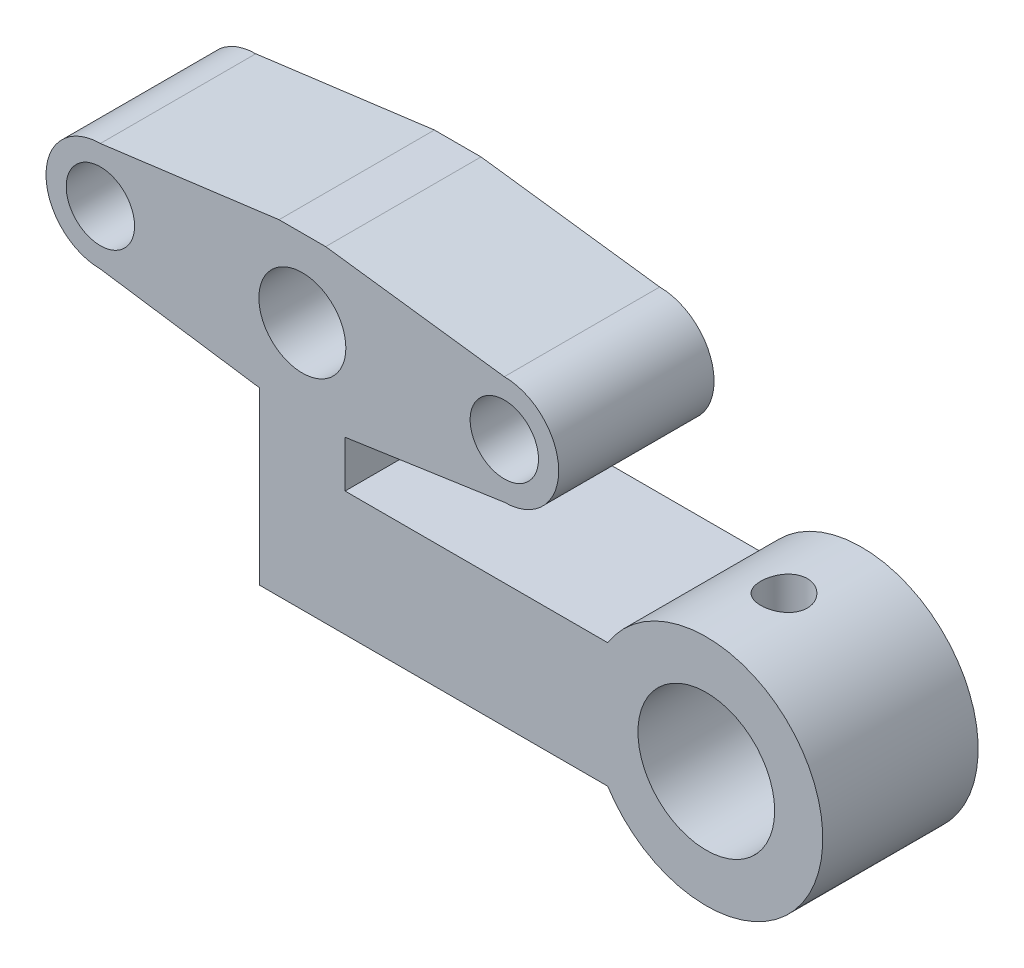
ISO-10303-21;
HEADER;
FILE_DESCRIPTION(('STEP AP214'),'2;1');
FILE_NAME('part.step','',(''),(''),'','','');
FILE_SCHEMA(('AUTOMOTIVE_DESIGN { 1 0 10303 214 1 1 1 1 }'));
ENDSEC;
DATA;
#1=APPLICATION_CONTEXT('core data for automotive mechanical design processes');
#2=APPLICATION_PROTOCOL_DEFINITION('international standard','automotive_design',2000,#1);
#3=PRODUCT_CONTEXT('',#1,'mechanical');
#4=PRODUCT('Part','Part','',(#3));
#5=PRODUCT_RELATED_PRODUCT_CATEGORY('part','',(#4));
#6=PRODUCT_DEFINITION_FORMATION('','',#4);
#7=PRODUCT_DEFINITION_CONTEXT('part definition',#1,'design');
#8=PRODUCT_DEFINITION('design','',#6,#7);
#9=PRODUCT_DEFINITION_SHAPE('','',#8);
#10=(LENGTH_UNIT() NAMED_UNIT(*) SI_UNIT(.MILLI.,.METRE.));
#11=(NAMED_UNIT(*) PLANE_ANGLE_UNIT() SI_UNIT($,.RADIAN.));
#12=(NAMED_UNIT(*) SI_UNIT($,.STERADIAN.) SOLID_ANGLE_UNIT());
#13=UNCERTAINTY_MEASURE_WITH_UNIT(LENGTH_MEASURE(1.E-05),#10,'distance_accuracy_value','');
#14=(GEOMETRIC_REPRESENTATION_CONTEXT(3) GLOBAL_UNCERTAINTY_ASSIGNED_CONTEXT((#13)) GLOBAL_UNIT_ASSIGNED_CONTEXT((#10,
#11,#12)) REPRESENTATION_CONTEXT('',''));
#15=CARTESIAN_POINT('',(0.,0.,0.));
#16=DIRECTION('',(0.,0.,1.));
#17=DIRECTION('',(1.,0.,0.));
#18=AXIS2_PLACEMENT_3D('',#15,#16,#17);
#19=CARTESIAN_POINT('',(0.,-16.,10.));
#20=DIRECTION('',(0.,1.,0.));
#21=DIRECTION('',(0.,0.,1.));
#22=AXIS2_PLACEMENT_3D('',#19,#20,#21);
#23=PLANE('',#22);
#24=DIRECTION('',(1.,0.,0.));
#25=VECTOR('',#24,1.);
#26=CARTESIAN_POINT('',(0.,-16.,0.));
#27=LINE('',#26,#25);
#28=CARTESIAN_POINT('',(-2.75,-16.,0.));
#29=VERTEX_POINT('',#28);
#30=CARTESIAN_POINT('',(19.6557112297752,-16.,0.));
#31=VERTEX_POINT('',#30);
#32=EDGE_CURVE('E163',#29,#31,#27,.T.);
#33=ORIENTED_EDGE('',*,*,#32,.T.);
#34=DIRECTION('',(0.,0.,-1.));
#35=VECTOR('',#34,1.);
#36=CARTESIAN_POINT('',(19.6557112297752,-16.,10.));
#37=LINE('',#36,#35);
#38=CARTESIAN_POINT('',(19.6557112297752,-16.,10.));
#39=VERTEX_POINT('',#38);
#40=EDGE_CURVE('E11',#39,#31,#37,.T.);
#41=ORIENTED_EDGE('',*,*,#40,.F.);
#42=DIRECTION('',(1.,0.,0.));
#43=VECTOR('',#42,1.);
#44=CARTESIAN_POINT('',(0.,-16.,10.));
#45=LINE('',#44,#43);
#46=CARTESIAN_POINT('',(-2.75,-16.,10.));
#47=VERTEX_POINT('',#46);
#48=EDGE_CURVE('E235',#47,#39,#45,.T.);
#49=ORIENTED_EDGE('',*,*,#48,.F.);
#50=DIRECTION('',(0.,0.,-1.));
#51=VECTOR('',#50,1.);
#52=CARTESIAN_POINT('',(-2.75,-16.,10.));
#53=LINE('',#52,#51);
#54=EDGE_CURVE('E159',#47,#29,#53,.T.);
#55=ORIENTED_EDGE('',*,*,#54,.T.);
#56=EDGE_LOOP('',(#33,#41,#49,#55));
#57=FACE_BOUND('',#56,.T.);
#58=ADVANCED_FACE('F34',(#57),#23,.F.);
#59=CARTESIAN_POINT('',(26.,-12.,10.));
#60=DIRECTION('',(0.,0.,-1.));
#61=DIRECTION('',(-1.,0.,0.));
#62=AXIS2_PLACEMENT_3D('',#59,#60,#61);
#63=CYLINDRICAL_SURFACE('',#62,7.5);
#64=CARTESIAN_POINT('',(24.5,-4.65153077165046,5.));
#65=CARTESIAN_POINT('',(24.5000030811876,-4.65152911461651,5.08334656323576));
#66=CARTESIAN_POINT('',(24.5069702424229,-4.65009737597381,5.16673193499975));
#67=CARTESIAN_POINT('',(24.5346315746256,-4.64453353042253,5.33114375771496));
#68=CARTESIAN_POINT('',(24.5553367293942,-4.64039926282702,5.41216826695404));
#69=CARTESIAN_POINT('',(24.6098063260704,-4.62991689417334,5.56945595503125));
#70=CARTESIAN_POINT('',(24.6435577787711,-4.62357099568418,5.64572378229887));
#71=CARTESIAN_POINT('',(24.7231263384942,-4.60938300778981,5.79151226704545));
#72=CARTESIAN_POINT('',(24.7689427720983,-4.601541001898,5.86103330080686));
#73=CARTESIAN_POINT('',(24.8720313865198,-4.58512050458629,5.99234150578078));
#74=CARTESIAN_POINT('',(24.92944151613,-4.57653393244132,6.05401938182596));
#75=CARTESIAN_POINT('',(25.053789816468,-4.559662915461,6.16693630036847));
#76=CARTESIAN_POINT('',(25.120728654533,-4.55137849183752,6.21817461112579));
#77=CARTESIAN_POINT('',(25.2629579661136,-4.53595805373657,6.30918202644269));
#78=CARTESIAN_POINT('',(25.3383161484917,-4.52883267837674,6.34884727072496));
#79=CARTESIAN_POINT('',(25.4947937744191,-4.51662394674552,6.4149124055722));
#80=CARTESIAN_POINT('',(25.5759126778692,-4.51154039933821,6.44131353785148));
#81=CARTESIAN_POINT('',(25.7404748400823,-4.50404518967372,6.47976079042944));
#82=CARTESIAN_POINT('',(25.8238733911778,-4.50159920567809,6.49199146635651));
#83=CARTESIAN_POINT('',(25.9915721473437,-4.49953618224594,6.50232642775747));
#84=CARTESIAN_POINT('',(26.0758722647478,-4.49991887020861,6.50043207446873));
#85=CARTESIAN_POINT('',(26.2417130011154,-4.50344347697227,6.48271072967667));
#86=CARTESIAN_POINT('',(26.3232758214477,-4.50654602451242,6.46708253424823));
#87=CARTESIAN_POINT('',(26.4825974398704,-4.51511734260887,6.42265245131166));
#88=CARTESIAN_POINT('',(26.5603560856207,-4.52058620783941,6.39385003671219));
#89=CARTESIAN_POINT('',(26.7104291948013,-4.53334055970062,6.3237049397791));
#90=CARTESIAN_POINT('',(26.7827062612008,-4.54063727737165,6.28228437334267));
#91=CARTESIAN_POINT('',(26.9193575687896,-4.55624295789322,6.1881363841451));
#92=CARTESIAN_POINT('',(26.9837308992875,-4.56455203717166,6.13540766034423));
#93=CARTESIAN_POINT('',(27.1039271465802,-4.5814355345331,6.01904956683729));
#94=CARTESIAN_POINT('',(27.1595814748604,-4.59001205313726,5.95524621990562));
#95=CARTESIAN_POINT('',(27.2594277397652,-4.60632642601859,5.81912533632387));
#96=CARTESIAN_POINT('',(27.3036194595916,-4.61406426443178,5.74680763867521));
#97=CARTESIAN_POINT('',(27.3793442222028,-4.62782928790614,5.5954687522673));
#98=CARTESIAN_POINT('',(27.4108499716666,-4.63385277654676,5.51643354854051));
#99=CARTESIAN_POINT('',(27.4600855124414,-4.64345285518091,5.35404301441401));
#100=CARTESIAN_POINT('',(27.477817099185,-4.64702976407358,5.27068824857137));
#101=CARTESIAN_POINT('',(27.4987490090541,-4.65126781098258,5.10355271300143));
#102=CARTESIAN_POINT('',(27.5021927883469,-4.65197779414268,5.01980363853449));
#103=CARTESIAN_POINT('',(27.4951064424661,-4.65053271466719,4.85292766520047));
#104=CARTESIAN_POINT('',(27.4845771096837,-4.64837781449418,4.7698007313217));
#105=CARTESIAN_POINT('',(27.4500533121112,-4.64149151257628,4.60734703956165));
#106=CARTESIAN_POINT('',(27.4261889312589,-4.63678501478255,4.52799148544636));
#107=CARTESIAN_POINT('',(27.3658115529628,-4.62534765972503,4.37440508145689));
#108=CARTESIAN_POINT('',(27.3292975135598,-4.61861663570595,4.30017465434642));
#109=CARTESIAN_POINT('',(27.2441062133234,-4.60377891056941,4.15788033507476));
#110=CARTESIAN_POINT('',(27.1952766169741,-4.59565542202645,4.08990943054876));
#111=CARTESIAN_POINT('',(27.0870433583191,-4.57899414260045,3.96303753199863));
#112=CARTESIAN_POINT('',(27.0276386077168,-4.57045630914273,3.90413747262612));
#113=CARTESIAN_POINT('',(26.8988484102468,-4.55376981196176,3.79615616122163));
#114=CARTESIAN_POINT('',(26.8293237483944,-4.54562913436974,3.747239518025));
#115=CARTESIAN_POINT('',(26.6829018449521,-4.5307930855707,3.66178117775062));
#116=CARTESIAN_POINT('',(26.6060049131503,-4.52409765367184,3.62523896098283));
#117=CARTESIAN_POINT('',(26.447454021236,-4.512940589084,3.56580669238005));
#118=CARTESIAN_POINT('',(26.3658300102171,-4.50846631286093,3.54283922266062));
#119=CARTESIAN_POINT('',(26.1997841820199,-4.5022014609351,3.51096312850423));
#120=CARTESIAN_POINT('',(26.1153627030668,-4.50041056200235,3.50205281078648));
#121=CARTESIAN_POINT('',(25.9476906591446,-4.49972189318819,3.49860952855567));
#122=CARTESIAN_POINT('',(25.8644452817877,-4.50077432175974,3.50382907931568));
#123=CARTESIAN_POINT('',(25.7000434530265,-4.50554934659523,3.52795092582172));
#124=CARTESIAN_POINT('',(25.6188869753695,-4.50927190928472,3.54685304952211));
#125=CARTESIAN_POINT('',(25.4611208753824,-4.518967524525,3.59769348813746));
#126=CARTESIAN_POINT('',(25.3845013351396,-4.52493544128134,3.62960206719677));
#127=CARTESIAN_POINT('',(25.2376681697211,-4.53847916814923,3.70551836199635));
#128=CARTESIAN_POINT('',(25.1674550513489,-4.54605510531172,3.74952703385557));
#129=CARTESIAN_POINT('',(25.0342041648405,-4.56213601263209,3.84922908059312));
#130=CARTESIAN_POINT('',(24.9713004258252,-4.5706539986683,3.90509950458016));
#131=CARTESIAN_POINT('',(24.8556760733647,-4.58758165644522,4.02657536014365));
#132=CARTESIAN_POINT('',(24.8029578751959,-4.59599130205524,4.09218309420307));
#133=CARTESIAN_POINT('',(24.7086616708172,-4.6118498587522,4.2321189750503));
#134=CARTESIAN_POINT('',(24.6672097780404,-4.61928744553629,4.30653344174069));
#135=CARTESIAN_POINT('',(24.5974639260682,-4.63222144222713,4.4613991599494));
#136=CARTESIAN_POINT('',(24.5691580310309,-4.63771961192251,4.54184485804634));
#137=CARTESIAN_POINT('',(24.5319962902187,-4.6450547830834,4.68539368315525));
#138=CARTESIAN_POINT('',(24.5200191522159,-4.64746822632176,4.74767812926849));
#139=CARTESIAN_POINT('',(24.504019973059,-4.65070682307289,4.87330093182915));
#140=CARTESIAN_POINT('',(24.4999976576556,-4.65153203134141,4.93663925186744));
#141=CARTESIAN_POINT('',(24.5,-4.65153077165046,5.));
#142=B_SPLINE_CURVE_WITH_KNOTS('',3,(#64,#65,#66,#67,#68,#69,#70,#71,#72,#73,#74,#75,#76,#77,
#78,#79,#80,#81,#82,#83,#84,#85,#86,#87,#88,#89,#90,#91,#92,#93,#94,#95,#96,#97,#98,#99,#100,
#101,#102,#103,#104,#105,#106,#107,#108,#109,#110,#111,#112,#113,#114,#115,#116,#117,#118,#119,
#120,#121,#122,#123,#124,#125,#126,#127,#128,#129,#130,#131,#132,#133,#134,#135,#136,#137,#138,
#139,#140,#141),.UNSPECIFIED.,.T.,.F.,(4,2,2,2,2,2,2,2,2,2,2,2,2,2,2,2,2,2,2,2,2,2,2,2,2,2,2,2,
2,2,2,2,2,2,2,2,2,2,4),(0.,0.249807695804143,0.499815358926445,0.74957474691088,
0.999320197289796,1.25223378822655,1.50516510053133,1.76030100656175,2.0154130236984,
2.26716373324621,2.51889018174372,2.76703184450306,3.01518343610625,3.26489886333455,
3.51464303655099,3.76874020143725,4.0228421718408,4.27748794759165,4.53210052524037,
4.7823563670689,5.03259801792632,5.28044012674978,5.52830265531598,5.77939589661782,
6.03051499305313,6.28548902600176,6.54045234945157,6.79394720367975,7.04741152037441,
7.29646526122029,7.54551587050135,7.79400025613177,8.04250428202026,8.29501728038395,
8.54759008334671,8.80288347868562,9.05794462633399,9.24785705455344,9.43776293526322),.UNSPECIFIED.);
#143=CARTESIAN_POINT('',(24.5,-4.65153077165046,5.));
#144=VERTEX_POINT('',#143);
#145=EDGE_CURVE('E431',#144,#144,#142,.T.);
#146=ORIENTED_EDGE('',*,*,#145,.F.);
#147=EDGE_LOOP('',(#146));
#148=FACE_BOUND('',#147,.T.);
#149=CARTESIAN_POINT('',(26.,-12.,0.));
#150=DIRECTION('',(0.,0.,1.));
#151=DIRECTION('',(1.,0.,0.));
#152=AXIS2_PLACEMENT_3D('',#149,#150,#151);
#153=CIRCLE('',#152,7.5);
#154=CARTESIAN_POINT('',(19.6557112297752,-8.,0.));
#155=VERTEX_POINT('',#154);
#156=EDGE_CURVE('E167',#31,#155,#153,.T.);
#157=ORIENTED_EDGE('',*,*,#156,.T.);
#158=DIRECTION('',(0.,0.,-1.));
#159=VECTOR('',#158,1.);
#160=CARTESIAN_POINT('',(19.6557112297752,-8.,10.));
#161=LINE('',#160,#159);
#162=CARTESIAN_POINT('',(19.6557112297752,-8.,10.));
#163=VERTEX_POINT('',#162);
#164=EDGE_CURVE('E43',#163,#155,#161,.T.);
#165=ORIENTED_EDGE('',*,*,#164,.F.);
#166=CARTESIAN_POINT('',(26.,-12.,10.));
#167=DIRECTION('',(0.,0.,1.));
#168=DIRECTION('',(1.,0.,0.));
#169=AXIS2_PLACEMENT_3D('',#166,#167,#168);
#170=CIRCLE('',#169,7.5);
#171=EDGE_CURVE('E106',#39,#163,#170,.T.);
#172=ORIENTED_EDGE('',*,*,#171,.F.);
#173=ORIENTED_EDGE('',*,*,#40,.T.);
#174=EDGE_LOOP('',(#157,#165,#172,#173));
#175=FACE_BOUND('',#174,.T.);
#176=ADVANCED_FACE('F217',(#148,#175),#63,.T.);
#177=CARTESIAN_POINT('',(0.,-8.00000000000001,10.));
#178=DIRECTION('',(0.,1.,0.));
#179=DIRECTION('',(-1.,0.,0.));
#180=AXIS2_PLACEMENT_3D('',#177,#178,#179);
#181=PLANE('',#180);
#182=DIRECTION('',(1.,0.,0.));
#183=VECTOR('',#182,1.);
#184=CARTESIAN_POINT('',(0.,-8.00000000000001,0.));
#185=LINE('',#184,#183);
#186=CARTESIAN_POINT('',(2.75,-8.,0.));
#187=VERTEX_POINT('',#186);
#188=EDGE_CURVE('E170',#187,#155,#185,.T.);
#189=ORIENTED_EDGE('',*,*,#188,.F.);
#190=DIRECTION('',(0.,0.,-1.));
#191=VECTOR('',#190,1.);
#192=CARTESIAN_POINT('',(2.75,-8.,10.));
#193=LINE('',#192,#191);
#194=CARTESIAN_POINT('',(2.75,-8.,10.));
#195=VERTEX_POINT('',#194);
#196=EDGE_CURVE('E210',#195,#187,#193,.T.);
#197=ORIENTED_EDGE('',*,*,#196,.F.);
#198=DIRECTION('',(1.,0.,0.));
#199=VECTOR('',#198,1.);
#200=CARTESIAN_POINT('',(0.,-8.00000000000001,10.));
#201=LINE('',#200,#199);
#202=EDGE_CURVE('E216',#195,#163,#201,.T.);
#203=ORIENTED_EDGE('',*,*,#202,.T.);
#204=ORIENTED_EDGE('',*,*,#164,.T.);
#205=EDGE_LOOP('',(#189,#197,#203,#204));
#206=FACE_BOUND('',#205,.T.);
#207=ADVANCED_FACE('F214',(#206),#181,.T.);
#208=CARTESIAN_POINT('',(2.75,0.,10.));
#209=DIRECTION('',(1.,0.,0.));
#210=DIRECTION('',(0.,1.,0.));
#211=AXIS2_PLACEMENT_3D('',#208,#209,#210);
#212=PLANE('',#211);
#213=DIRECTION('',(0.,-1.,0.));
#214=VECTOR('',#213,1.);
#215=CARTESIAN_POINT('',(2.75,0.,0.));
#216=LINE('',#215,#214);
#217=CARTESIAN_POINT('',(2.75,-5.,0.));
#218=VERTEX_POINT('',#217);
#219=EDGE_CURVE('E173',#218,#187,#216,.T.);
#220=ORIENTED_EDGE('',*,*,#219,.F.);
#221=DIRECTION('',(0.,0.,-1.));
#222=VECTOR('',#221,1.);
#223=CARTESIAN_POINT('',(2.75,-5.,10.));
#224=LINE('',#223,#222);
#225=CARTESIAN_POINT('',(2.75,-5.,10.));
#226=VERTEX_POINT('',#225);
#227=EDGE_CURVE('E208',#226,#218,#224,.T.);
#228=ORIENTED_EDGE('',*,*,#227,.F.);
#229=DIRECTION('',(0.,-1.,0.));
#230=VECTOR('',#229,1.);
#231=CARTESIAN_POINT('',(2.75,0.,10.));
#232=LINE('',#231,#230);
#233=EDGE_CURVE('E231',#226,#195,#232,.T.);
#234=ORIENTED_EDGE('',*,*,#233,.T.);
#235=ORIENTED_EDGE('',*,*,#196,.T.);
#236=EDGE_LOOP('',(#220,#228,#234,#235));
#237=FACE_BOUND('',#236,.T.);
#238=ADVANCED_FACE('F227',(#237),#212,.T.);
#239=CARTESIAN_POINT('',(0.774024461269656,-5.28916715200932,10.));
#240=DIRECTION('',(-0.144799180117186,0.989461064134103,0.));
#241=DIRECTION('',(-0.989461064134103,-0.144799180117186,0.));
#242=AXIS2_PLACEMENT_3D('',#239,#240,#241);
#243=PLANE('',#242);
#244=DIRECTION('',(0.989461064134103,0.144799180117186,0.));
#245=VECTOR('',#244,1.);
#246=CARTESIAN_POINT('',(0.774024461269656,-5.28916715200932,0.));
#247=LINE('',#246,#245);
#248=CARTESIAN_POINT('',(13.,-3.5,0.));
#249=VERTEX_POINT('',#248);
#250=EDGE_CURVE('E176',#218,#249,#247,.T.);
#251=ORIENTED_EDGE('',*,*,#250,.T.);
#252=DIRECTION('',(0.,0.,-1.));
#253=VECTOR('',#252,1.);
#254=CARTESIAN_POINT('',(13.,-3.5,10.));
#255=LINE('',#254,#253);
#256=CARTESIAN_POINT('',(13.,-3.5,10.));
#257=VERTEX_POINT('',#256);
#258=EDGE_CURVE('E205',#257,#249,#255,.T.);
#259=ORIENTED_EDGE('',*,*,#258,.F.);
#260=DIRECTION('',(0.989461064134103,0.144799180117186,0.));
#261=VECTOR('',#260,1.);
#262=CARTESIAN_POINT('',(0.774024461269656,-5.28916715200932,10.));
#263=LINE('',#262,#261);
#264=EDGE_CURVE('E233',#226,#257,#263,.T.);
#265=ORIENTED_EDGE('',*,*,#264,.F.);
#266=ORIENTED_EDGE('',*,*,#227,.T.);
#267=EDGE_LOOP('',(#251,#259,#265,#266));
#268=FACE_BOUND('',#267,.T.);
#269=ADVANCED_FACE('F279',(#268),#243,.F.);
#270=CARTESIAN_POINT('',(13.,0.,10.));
#271=DIRECTION('',(0.,0.,-1.));
#272=DIRECTION('',(-1.,0.,0.));
#273=AXIS2_PLACEMENT_3D('',#270,#271,#272);
#274=CYLINDRICAL_SURFACE('',#273,3.5);
#275=CARTESIAN_POINT('',(13.,0.,0.));
#276=DIRECTION('',(0.,0.,1.));
#277=DIRECTION('',(1.,0.,0.));
#278=AXIS2_PLACEMENT_3D('',#275,#276,#277);
#279=CIRCLE('',#278,3.5);
#280=CARTESIAN_POINT('',(13.,3.5,0.));
#281=VERTEX_POINT('',#280);
#282=EDGE_CURVE('E178',#249,#281,#279,.T.);
#283=ORIENTED_EDGE('',*,*,#282,.T.);
#284=DIRECTION('',(0.,0.,-1.));
#285=VECTOR('',#284,1.);
#286=CARTESIAN_POINT('',(13.,3.5,10.));
#287=LINE('',#286,#285);
#288=CARTESIAN_POINT('',(13.,3.5,10.));
#289=VERTEX_POINT('',#288);
#290=EDGE_CURVE('E203',#289,#281,#287,.T.);
#291=ORIENTED_EDGE('',*,*,#290,.F.);
#292=CARTESIAN_POINT('',(13.,0.,10.));
#293=DIRECTION('',(0.,0.,1.));
#294=DIRECTION('',(1.,0.,0.));
#295=AXIS2_PLACEMENT_3D('',#292,#293,#294);
#296=CIRCLE('',#295,3.5);
#297=EDGE_CURVE('E240',#257,#289,#296,.T.);
#298=ORIENTED_EDGE('',*,*,#297,.F.);
#299=ORIENTED_EDGE('',*,*,#258,.T.);
#300=EDGE_LOOP('',(#283,#291,#298,#299));
#301=FACE_BOUND('',#300,.T.);
#302=ADVANCED_FACE('F282',(#301),#274,.T.);
#303=CARTESIAN_POINT('',(0.66635687732342,5.10873605947955,10.));
#304=DIRECTION('',(0.129339184067768,0.991600411186222,0.));
#305=DIRECTION('',(-0.991600411186222,0.129339184067768,0.));
#306=AXIS2_PLACEMENT_3D('',#303,#304,#305);
#307=PLANE('',#306);
#308=DIRECTION('',(0.991600411186222,-0.129339184067768,0.));
#309=VECTOR('',#308,1.);
#310=CARTESIAN_POINT('',(0.66635687732342,5.10873605947955,0.));
#311=LINE('',#310,#309);
#312=CARTESIAN_POINT('',(1.5,5.,0.));
#313=VERTEX_POINT('',#312);
#314=EDGE_CURVE('E181',#313,#281,#311,.T.);
#315=ORIENTED_EDGE('',*,*,#314,.F.);
#316=DIRECTION('',(0.,0.,-1.));
#317=VECTOR('',#316,1.);
#318=CARTESIAN_POINT('',(1.5,5.,10.));
#319=LINE('',#318,#317);
#320=CARTESIAN_POINT('',(1.5,5.,10.));
#321=VERTEX_POINT('',#320);
#322=EDGE_CURVE('E201',#321,#313,#319,.T.);
#323=ORIENTED_EDGE('',*,*,#322,.F.);
#324=DIRECTION('',(0.991600411186222,-0.129339184067768,0.));
#325=VECTOR('',#324,1.);
#326=CARTESIAN_POINT('',(0.66635687732342,5.10873605947955,10.));
#327=LINE('',#326,#325);
#328=EDGE_CURVE('E242',#321,#289,#327,.T.);
#329=ORIENTED_EDGE('',*,*,#328,.T.);
#330=ORIENTED_EDGE('',*,*,#290,.T.);
#331=EDGE_LOOP('',(#315,#323,#329,#330));
#332=FACE_BOUND('',#331,.T.);
#333=ADVANCED_FACE('F255',(#332),#307,.T.);
#334=CARTESIAN_POINT('',(0.,5.,10.));
#335=DIRECTION('',(0.,1.,0.));
#336=DIRECTION('',(0.,0.,1.));
#337=AXIS2_PLACEMENT_3D('',#334,#335,#336);
#338=PLANE('',#337);
#339=DIRECTION('',(1.,0.,0.));
#340=VECTOR('',#339,1.);
#341=CARTESIAN_POINT('',(0.,5.,0.));
#342=LINE('',#341,#340);
#343=CARTESIAN_POINT('',(-1.5,5.,0.));
#344=VERTEX_POINT('',#343);
#345=EDGE_CURVE('E184',#344,#313,#342,.T.);
#346=ORIENTED_EDGE('',*,*,#345,.F.);
#347=DIRECTION('',(0.,0.,-1.));
#348=VECTOR('',#347,1.);
#349=CARTESIAN_POINT('',(-1.5,5.,10.));
#350=LINE('',#349,#348);
#351=CARTESIAN_POINT('',(-1.5,5.,10.));
#352=VERTEX_POINT('',#351);
#353=EDGE_CURVE('E199',#352,#344,#350,.T.);
#354=ORIENTED_EDGE('',*,*,#353,.F.);
#355=DIRECTION('',(1.,0.,0.));
#356=VECTOR('',#355,1.);
#357=CARTESIAN_POINT('',(0.,5.,10.));
#358=LINE('',#357,#356);
#359=EDGE_CURVE('E245',#352,#321,#358,.T.);
#360=ORIENTED_EDGE('',*,*,#359,.T.);
#361=ORIENTED_EDGE('',*,*,#322,.T.);
#362=EDGE_LOOP('',(#346,#354,#360,#361));
#363=FACE_BOUND('',#362,.T.);
#364=ADVANCED_FACE('F249',(#363),#338,.T.);
#365=CARTESIAN_POINT('',(-0.66635687732342,5.10873605947955,10.));
#366=DIRECTION('',(0.129339184067768,-0.991600411186222,0.));
#367=DIRECTION('',(0.991600411186222,0.129339184067768,0.));
#368=AXIS2_PLACEMENT_3D('',#365,#366,#367);
#369=PLANE('',#368);
#370=DIRECTION('',(-0.991600411186222,-0.129339184067768,0.));
#371=VECTOR('',#370,1.);
#372=CARTESIAN_POINT('',(-0.66635687732342,5.10873605947955,0.));
#373=LINE('',#372,#371);
#374=CARTESIAN_POINT('',(-13.,3.5,0.));
#375=VERTEX_POINT('',#374);
#376=EDGE_CURVE('E187',#344,#375,#373,.T.);
#377=ORIENTED_EDGE('',*,*,#376,.T.);
#378=DIRECTION('',(0.,0.,-1.));
#379=VECTOR('',#378,1.);
#380=CARTESIAN_POINT('',(-13.,3.5,10.));
#381=LINE('',#380,#379);
#382=CARTESIAN_POINT('',(-13.,3.5,10.));
#383=VERTEX_POINT('',#382);
#384=EDGE_CURVE('E148',#383,#375,#381,.T.);
#385=ORIENTED_EDGE('',*,*,#384,.F.);
#386=DIRECTION('',(-0.991600411186222,-0.129339184067768,0.));
#387=VECTOR('',#386,1.);
#388=CARTESIAN_POINT('',(-0.66635687732342,5.10873605947955,10.));
#389=LINE('',#388,#387);
#390=EDGE_CURVE('E139',#352,#383,#389,.T.);
#391=ORIENTED_EDGE('',*,*,#390,.F.);
#392=ORIENTED_EDGE('',*,*,#353,.T.);
#393=EDGE_LOOP('',(#377,#385,#391,#392));
#394=FACE_BOUND('',#393,.T.);
#395=ADVANCED_FACE('F258',(#394),#369,.F.);
#396=CARTESIAN_POINT('',(-13.,0.,10.));
#397=DIRECTION('',(0.,0.,-1.));
#398=DIRECTION('',(-1.,0.,0.));
#399=AXIS2_PLACEMENT_3D('',#396,#397,#398);
#400=CYLINDRICAL_SURFACE('',#399,3.5);
#401=CARTESIAN_POINT('',(-13.,0.,0.));
#402=DIRECTION('',(0.,0.,1.));
#403=DIRECTION('',(1.,0.,0.));
#404=AXIS2_PLACEMENT_3D('',#401,#402,#403);
#405=CIRCLE('',#404,3.5);
#406=CARTESIAN_POINT('',(-13.,-3.5,0.));
#407=VERTEX_POINT('',#406);
#408=EDGE_CURVE('E147',#375,#407,#405,.T.);
#409=ORIENTED_EDGE('',*,*,#408,.T.);
#410=DIRECTION('',(0.,0.,-1.));
#411=VECTOR('',#410,1.);
#412=CARTESIAN_POINT('',(-13.,-3.5,10.));
#413=LINE('',#412,#411);
#414=CARTESIAN_POINT('',(-13.,-3.5,10.));
#415=VERTEX_POINT('',#414);
#416=EDGE_CURVE('E144',#415,#407,#413,.T.);
#417=ORIENTED_EDGE('',*,*,#416,.F.);
#418=CARTESIAN_POINT('',(-13.,0.,10.));
#419=DIRECTION('',(0.,0.,1.));
#420=DIRECTION('',(1.,0.,0.));
#421=AXIS2_PLACEMENT_3D('',#418,#419,#420);
#422=CIRCLE('',#421,3.5);
#423=EDGE_CURVE('E131',#383,#415,#422,.T.);
#424=ORIENTED_EDGE('',*,*,#423,.F.);
#425=ORIENTED_EDGE('',*,*,#384,.T.);
#426=EDGE_LOOP('',(#409,#417,#424,#425));
#427=FACE_BOUND('',#426,.T.);
#428=ADVANCED_FACE('F145',(#427),#400,.T.);
#429=CARTESIAN_POINT('',(-0.774024461269657,-5.28916715200932,10.));
#430=DIRECTION('',(0.144799180117186,0.989461064134103,0.));
#431=DIRECTION('',(-0.989461064134103,0.144799180117186,0.));
#432=AXIS2_PLACEMENT_3D('',#429,#430,#431);
#433=PLANE('',#432);
#434=DIRECTION('',(0.989461064134103,-0.144799180117186,0.));
#435=VECTOR('',#434,1.);
#436=CARTESIAN_POINT('',(-0.774024461269657,-5.28916715200932,0.));
#437=LINE('',#436,#435);
#438=CARTESIAN_POINT('',(-2.75,-5.,0.));
#439=VERTEX_POINT('',#438);
#440=EDGE_CURVE('E92',#407,#439,#437,.T.);
#441=ORIENTED_EDGE('',*,*,#440,.T.);
#442=DIRECTION('',(0.,0.,-1.));
#443=VECTOR('',#442,1.);
#444=CARTESIAN_POINT('',(-2.75,-5.,10.));
#445=LINE('',#444,#443);
#446=CARTESIAN_POINT('',(-2.75,-5.,10.));
#447=VERTEX_POINT('',#446);
#448=EDGE_CURVE('E149',#447,#439,#445,.T.);
#449=ORIENTED_EDGE('',*,*,#448,.F.);
#450=DIRECTION('',(0.989461064134103,-0.144799180117186,0.));
#451=VECTOR('',#450,1.);
#452=CARTESIAN_POINT('',(-0.774024461269657,-5.28916715200932,10.));
#453=LINE('',#452,#451);
#454=EDGE_CURVE('E136',#415,#447,#453,.T.);
#455=ORIENTED_EDGE('',*,*,#454,.F.);
#456=ORIENTED_EDGE('',*,*,#416,.T.);
#457=EDGE_LOOP('',(#441,#449,#455,#456));
#458=FACE_BOUND('',#457,.T.);
#459=ADVANCED_FACE('F151',(#458),#433,.F.);
#460=CARTESIAN_POINT('',(-2.75,0.,10.));
#461=DIRECTION('',(1.,0.,0.));
#462=DIRECTION('',(0.,1.,0.));
#463=AXIS2_PLACEMENT_3D('',#460,#461,#462);
#464=PLANE('',#463);
#465=DIRECTION('',(0.,-1.,0.));
#466=VECTOR('',#465,1.);
#467=CARTESIAN_POINT('',(-2.75,0.,0.));
#468=LINE('',#467,#466);
#469=EDGE_CURVE('E98',#439,#29,#468,.T.);
#470=ORIENTED_EDGE('',*,*,#469,.T.);
#471=ORIENTED_EDGE('',*,*,#54,.F.);
#472=DIRECTION('',(0.,-1.,0.));
#473=VECTOR('',#472,1.);
#474=CARTESIAN_POINT('',(-2.75,0.,10.));
#475=LINE('',#474,#473);
#476=EDGE_CURVE('E51',#447,#47,#475,.T.);
#477=ORIENTED_EDGE('',*,*,#476,.F.);
#478=ORIENTED_EDGE('',*,*,#448,.T.);
#479=EDGE_LOOP('',(#470,#471,#477,#478));
#480=FACE_BOUND('',#479,.T.);
#481=ADVANCED_FACE('F315',(#480),#464,.F.);
#482=CARTESIAN_POINT('',(26.,-12.,10.));
#483=DIRECTION('',(0.,0.,-1.));
#484=DIRECTION('',(-1.,0.,0.));
#485=AXIS2_PLACEMENT_3D('',#482,#483,#484);
#486=CYLINDRICAL_SURFACE('',#485,4.4);
#487=CARTESIAN_POINT('',(24.5,-7.86357642401071,5.));
#488=CARTESIAN_POINT('',(24.4999992140049,-7.863577047921,5.08158258137132));
#489=CARTESIAN_POINT('',(24.5066781677432,-7.86113649022482,5.16315979491508));
#490=CARTESIAN_POINT('',(24.5331220686913,-7.85169165450791,5.32388985370917));
#491=CARTESIAN_POINT('',(24.5528886801661,-7.84468679607905,5.40304238929081));
#492=CARTESIAN_POINT('',(24.6047268269282,-7.82699702189821,5.55656711897757));
#493=CARTESIAN_POINT('',(24.6367733419379,-7.81631959349964,5.63094867653165));
#494=CARTESIAN_POINT('',(24.7121755420429,-7.79249884612861,5.77330485544053));
#495=CARTESIAN_POINT('',(24.7555338976415,-7.77935494507643,5.8412779587197));
#496=CARTESIAN_POINT('',(24.8542307763214,-7.75147873621066,5.97167100940464));
#497=CARTESIAN_POINT('',(24.9099548285264,-7.73670553793475,6.03379047556803));
#498=CARTESIAN_POINT('',(25.0309793561663,-7.70758011628093,6.14800877475378));
#499=CARTESIAN_POINT('',(25.0962814471117,-7.69322796441117,6.20010591389505));
#500=CARTESIAN_POINT('',(25.2368201689808,-7.66608612109601,6.29417851786779));
#501=CARTESIAN_POINT('',(25.3122801929456,-7.65335009479074,6.33583710161844));
#502=CARTESIAN_POINT('',(25.4696459465761,-7.63135897037674,6.40574931387181));
#503=CARTESIAN_POINT('',(25.5515498462609,-7.62210288829101,6.43400673223342));
#504=CARTESIAN_POINT('',(25.7163263895312,-7.60840429848913,6.47528951231926));
#505=CARTESIAN_POINT('',(25.7990562050845,-7.60379941126651,6.48883006481643));
#506=CARTESIAN_POINT('',(25.9657332944299,-7.5993445580618,6.50193505848136));
#507=CARTESIAN_POINT('',(26.0496802342268,-7.59949331140949,6.501503263915));
#508=CARTESIAN_POINT('',(26.2127540944233,-7.60442010527888,6.48699797019435));
#509=CARTESIAN_POINT('',(26.2919375210878,-7.60900809559142,6.47348450494978));
#510=CARTESIAN_POINT('',(26.4468367931741,-7.62205739024208,6.43412834975374));
#511=CARTESIAN_POINT('',(26.5225524005929,-7.6305189599944,6.40828481495183));
#512=CARTESIAN_POINT('',(26.6695660266196,-7.6506018242841,6.3446871883204));
#513=CARTESIAN_POINT('',(26.7407909751518,-7.66226406657544,6.30677765049067));
#514=CARTESIAN_POINT('',(26.8760307511932,-7.68754012582647,6.22025371211121));
#515=CARTESIAN_POINT('',(26.9400435025462,-7.70115450219161,6.17163624093758));
#516=CARTESIAN_POINT('',(27.0623686967465,-7.72969415304398,6.06227529034873));
#517=CARTESIAN_POINT('',(27.1202468884783,-7.7446509708599,6.0010536048047));
#518=CARTESIAN_POINT('',(27.2250595923804,-7.77363118937172,5.86965147916945));
#519=CARTESIAN_POINT('',(27.2719922526515,-7.78765443182749,5.79946952617402));
#520=CARTESIAN_POINT('',(27.3542206708361,-7.8133571555,5.65070538856886));
#521=CARTESIAN_POINT('',(27.3893245839833,-7.82499689747902,5.57200976784035));
#522=CARTESIAN_POINT('',(27.445632003647,-7.84415553668969,5.4093266438485));
#523=CARTESIAN_POINT('',(27.46684165869,-7.85167625644083,5.3253414993803));
#524=CARTESIAN_POINT('',(27.4938565419635,-7.86132992756908,5.15868590511855));
#525=CARTESIAN_POINT('',(27.5003380899117,-7.86369919892066,5.07613877794153));
#526=CARTESIAN_POINT('',(27.4996348530668,-7.8634438374396,4.91111985180275));
#527=CARTESIAN_POINT('',(27.4924526991635,-7.86082016597763,4.82864804139804));
#528=CARTESIAN_POINT('',(27.4652347315949,-7.85111094279887,4.66926258137984));
#529=CARTESIAN_POINT('',(27.4456776998498,-7.8441917641991,4.59225593386585));
#530=CARTESIAN_POINT('',(27.3948444319989,-7.82685667966362,4.44263577192661));
#531=CARTESIAN_POINT('',(27.3635660589245,-7.81644013614416,4.3700230613846));
#532=CARTESIAN_POINT('',(27.2890136046482,-7.79286130356569,4.22861051607496));
#533=CARTESIAN_POINT('',(27.2453796559777,-7.77962014839868,4.16001391397932));
#534=CARTESIAN_POINT('',(27.1477579923027,-7.75203336636908,4.03087243599786));
#535=CARTESIAN_POINT('',(27.0937670912458,-7.73768740045455,3.97033004751643));
#536=CARTESIAN_POINT('',(26.9737158508131,-7.70862784515774,3.85584134003732));
#537=CARTESIAN_POINT('',(26.9071824155296,-7.69393248658058,3.80238498514861));
#538=CARTESIAN_POINT('',(26.765727296046,-7.66654362041764,3.70735938599084));
#539=CARTESIAN_POINT('',(26.6908058671073,-7.65385005194219,3.66578978012403));
#540=CARTESIAN_POINT('',(26.5350304596723,-7.63194742409901,3.59608574848391));
#541=CARTESIAN_POINT('',(26.4542164338421,-7.62271710775932,3.56786907515922));
#542=CARTESIAN_POINT('',(26.2886114993869,-7.60869083466393,3.52555103319871));
#543=CARTESIAN_POINT('',(26.203822112749,-7.60389319516892,3.5114443079555));
#544=CARTESIAN_POINT('',(26.0371449209381,-7.59940561068323,3.4982459681528));
#545=CARTESIAN_POINT('',(25.9553185431085,-7.5994768859127,3.49845241909319));
#546=CARTESIAN_POINT('',(25.7929205891859,-7.6041251884664,3.51213016847933));
#547=CARTESIAN_POINT('',(25.712348903923,-7.60870182153218,3.52560030623582));
#548=CARTESIAN_POINT('',(25.5561369801788,-7.62175493527267,3.56495147393252));
#549=CARTESIAN_POINT('',(25.4804356452151,-7.63016277393888,3.59061438301542));
#550=CARTESIAN_POINT('',(25.3343873798679,-7.650011795406,3.6534183567785));
#551=CARTESIAN_POINT('',(25.2640414347093,-7.6614535346228,3.6905615271402));
#552=CARTESIAN_POINT('',(25.1277853694529,-7.68673822025783,3.77689271057095));
#553=CARTESIAN_POINT('',(25.0621452299909,-7.70065586557935,3.82648464181291));
#554=CARTESIAN_POINT('',(24.93989109113,-7.72915503833227,3.9356277067914));
#555=CARTESIAN_POINT('',(24.8832800496757,-7.74373678132,3.99518209120343));
#556=CARTESIAN_POINT('',(24.7782988996756,-7.7726441624285,4.12550996602453));
#557=CARTESIAN_POINT('',(24.7303679303635,-7.78693409933743,4.19664630816095));
#558=CARTESIAN_POINT('',(24.647167058056,-7.81290654132333,4.3464126276016));
#559=CARTESIAN_POINT('',(24.6118945792898,-7.82458957667374,4.42504107627407));
#560=CARTESIAN_POINT('',(24.5560750341557,-7.84356763265535,4.58520609932851));
#561=CARTESIAN_POINT('',(24.5351188074172,-7.85098352846062,4.66658518204009));
#562=CARTESIAN_POINT('',(24.5070843958963,-7.86098666318951,4.83197876622488));
#563=CARTESIAN_POINT('',(24.5000008093602,-7.86357578155357,4.91599222896632));
#564=CARTESIAN_POINT('',(24.5,-7.86357642401071,5.));
#565=B_SPLINE_CURVE_WITH_KNOTS('',3,(#487,#488,#489,#490,#491,#492,#493,#494,#495,#496,#497,
#498,#499,#500,#501,#502,#503,#504,#505,#506,#507,#508,#509,#510,#511,#512,#513,#514,#515,#516,
#517,#518,#519,#520,#521,#522,#523,#524,#525,#526,#527,#528,#529,#530,#531,#532,#533,#534,#535,
#536,#537,#538,#539,#540,#541,#542,#543,#544,#545,#546,#547,#548,#549,#550,#551,#552,#553,#554,
#555,#556,#557,#558,#559,#560,#561,#562,#563,#564),.UNSPECIFIED.,.T.,.F.,(4,2,2,2,2,2,2,2,2,2,2,
2,2,2,2,2,2,2,2,2,2,2,2,2,2,2,2,2,2,2,2,2,2,2,2,2,2,2,4),(0.,0.244436346098291,
0.488903781414079,0.732875740821926,0.976905349414305,1.23000917794676,1.48315574624041,
1.74324701056574,2.00326467697513,2.25385353272529,2.50437487832735,2.74462488218904,
2.9848913502302,3.22838777774991,3.47195412181332,3.72748045498226,3.98304998991931,
4.24258470220536,4.50200448673427,4.74924771570339,4.99644334381848,5.23461531681462,
5.47283073312033,5.71886102292836,5.96496711941003,6.22354924471785,6.48212350305851,
6.7390836444722,6.99594619816983,7.24022127475741,7.48447497702668,7.72451483324255,
7.96459874313663,8.21380190782785,8.46308654486053,8.72270959948625,8.98227979558847,
9.23408051993522,9.48578317815184),.UNSPECIFIED.);
#566=CARTESIAN_POINT('',(24.5,-7.86357642401071,5.));
#567=VERTEX_POINT('',#566);
#568=EDGE_CURVE('E164',#567,#567,#565,.T.);
#569=ORIENTED_EDGE('',*,*,#568,.T.);
#570=EDGE_LOOP('',(#569));
#571=FACE_BOUND('',#570,.T.);
#572=CARTESIAN_POINT('',(26.,-12.,10.));
#573=DIRECTION('',(0.,0.,1.));
#574=DIRECTION('',(1.,0.,0.));
#575=AXIS2_PLACEMENT_3D('',#572,#573,#574);
#576=CIRCLE('',#575,4.4);
#577=CARTESIAN_POINT('',(30.4,-12.,10.));
#578=VERTEX_POINT('',#577);
#579=EDGE_CURVE('E195',#578,#578,#576,.T.);
#580=ORIENTED_EDGE('',*,*,#579,.T.);
#581=EDGE_LOOP('',(#580));
#582=FACE_BOUND('',#581,.T.);
#583=CARTESIAN_POINT('',(26.,-12.,0.));
#584=DIRECTION('',(0.,0.,1.));
#585=DIRECTION('',(1.,0.,0.));
#586=AXIS2_PLACEMENT_3D('',#583,#584,#585);
#587=CIRCLE('',#586,4.4);
#588=CARTESIAN_POINT('',(30.4,-12.,0.));
#589=VERTEX_POINT('',#588);
#590=EDGE_CURVE('E160',#589,#589,#587,.T.);
#591=ORIENTED_EDGE('',*,*,#590,.F.);
#592=EDGE_LOOP('',(#591));
#593=FACE_BOUND('',#592,.T.);
#594=ADVANCED_FACE('F36',(#571,#582,#593),#486,.F.);
#595=CARTESIAN_POINT('',(0.,0.,10.));
#596=DIRECTION('',(0.,0.,-1.));
#597=DIRECTION('',(-1.,0.,0.));
#598=AXIS2_PLACEMENT_3D('',#595,#596,#597);
#599=CYLINDRICAL_SURFACE('',#598,2.8);
#600=CARTESIAN_POINT('',(0.,0.,10.));
#601=DIRECTION('',(0.,0.,1.));
#602=DIRECTION('',(1.,0.,0.));
#603=AXIS2_PLACEMENT_3D('',#600,#601,#602);
#604=CIRCLE('',#603,2.8);
#605=CARTESIAN_POINT('',(2.8,0.,10.));
#606=VERTEX_POINT('',#605);
#607=EDGE_CURVE('E153',#606,#606,#604,.T.);
#608=ORIENTED_EDGE('',*,*,#607,.T.);
#609=EDGE_LOOP('',(#608));
#610=FACE_BOUND('',#609,.T.);
#611=CARTESIAN_POINT('',(0.,0.,0.));
#612=DIRECTION('',(0.,0.,1.));
#613=DIRECTION('',(1.,0.,0.));
#614=AXIS2_PLACEMENT_3D('',#611,#612,#613);
#615=CIRCLE('',#614,2.8);
#616=CARTESIAN_POINT('',(2.8,0.,0.));
#617=VERTEX_POINT('',#616);
#618=EDGE_CURVE('E192',#617,#617,#615,.T.);
#619=ORIENTED_EDGE('',*,*,#618,.F.);
#620=EDGE_LOOP('',(#619));
#621=FACE_BOUND('',#620,.T.);
#622=ADVANCED_FACE('F330',(#610,#621),#599,.F.);
#623=CARTESIAN_POINT('',(0.,0.,10.));
#624=DIRECTION('',(0.,0.,1.));
#625=DIRECTION('',(1.,0.,0.));
#626=AXIS2_PLACEMENT_3D('',#623,#624,#625);
#627=PLANE('',#626);
#628=CARTESIAN_POINT('',(13.,0.,10.));
#629=DIRECTION('',(0.,0.,1.));
#630=DIRECTION('',(1.,0.,0.));
#631=AXIS2_PLACEMENT_3D('',#628,#629,#630);
#632=CIRCLE('',#631,2.2);
#633=CARTESIAN_POINT('',(15.2,0.,10.));
#634=VERTEX_POINT('',#633);
#635=EDGE_CURVE('E460',#634,#634,#632,.T.);
#636=ORIENTED_EDGE('',*,*,#635,.F.);
#637=EDGE_LOOP('',(#636));
#638=FACE_BOUND('',#637,.T.);
#639=CARTESIAN_POINT('',(-13.,0.,10.));
#640=DIRECTION('',(0.,0.,1.));
#641=DIRECTION('',(1.,0.,0.));
#642=AXIS2_PLACEMENT_3D('',#639,#640,#641);
#643=CIRCLE('',#642,2.2);
#644=CARTESIAN_POINT('',(-10.8,0.,10.));
#645=VERTEX_POINT('',#644);
#646=EDGE_CURVE('E438',#645,#645,#643,.T.);
#647=ORIENTED_EDGE('',*,*,#646,.F.);
#648=EDGE_LOOP('',(#647));
#649=FACE_BOUND('',#648,.T.);
#650=ORIENTED_EDGE('',*,*,#579,.F.);
#651=EDGE_LOOP('',(#650));
#652=FACE_BOUND('',#651,.T.);
#653=ORIENTED_EDGE('',*,*,#48,.T.);
#654=ORIENTED_EDGE('',*,*,#171,.T.);
#655=ORIENTED_EDGE('',*,*,#202,.F.);
#656=ORIENTED_EDGE('',*,*,#233,.F.);
#657=ORIENTED_EDGE('',*,*,#264,.T.);
#658=ORIENTED_EDGE('',*,*,#297,.T.);
#659=ORIENTED_EDGE('',*,*,#328,.F.);
#660=ORIENTED_EDGE('',*,*,#359,.F.);
#661=ORIENTED_EDGE('',*,*,#390,.T.);
#662=ORIENTED_EDGE('',*,*,#423,.T.);
#663=ORIENTED_EDGE('',*,*,#454,.T.);
#664=ORIENTED_EDGE('',*,*,#476,.T.);
#665=EDGE_LOOP('',(#653,#654,#655,#656,#657,#658,#659,#660,#661,#662,#663,#664));
#666=FACE_BOUND('',#665,.T.);
#667=ORIENTED_EDGE('',*,*,#607,.F.);
#668=EDGE_LOOP('',(#667));
#669=FACE_BOUND('',#668,.T.);
#670=ADVANCED_FACE('F133',(#638,#649,#652,#666,#669),#627,.T.);
#671=CARTESIAN_POINT('',(0.,0.,0.));
#672=DIRECTION('',(0.,0.,1.));
#673=DIRECTION('',(1.,0.,0.));
#674=AXIS2_PLACEMENT_3D('',#671,#672,#673);
#675=PLANE('',#674);
#676=ORIENTED_EDGE('',*,*,#590,.T.);
#677=EDGE_LOOP('',(#676));
#678=FACE_BOUND('',#677,.T.);
#679=ORIENTED_EDGE('',*,*,#32,.F.);
#680=ORIENTED_EDGE('',*,*,#469,.F.);
#681=ORIENTED_EDGE('',*,*,#440,.F.);
#682=ORIENTED_EDGE('',*,*,#408,.F.);
#683=ORIENTED_EDGE('',*,*,#376,.F.);
#684=ORIENTED_EDGE('',*,*,#345,.T.);
#685=ORIENTED_EDGE('',*,*,#314,.T.);
#686=ORIENTED_EDGE('',*,*,#282,.F.);
#687=ORIENTED_EDGE('',*,*,#250,.F.);
#688=ORIENTED_EDGE('',*,*,#219,.T.);
#689=ORIENTED_EDGE('',*,*,#188,.T.);
#690=ORIENTED_EDGE('',*,*,#156,.F.);
#691=EDGE_LOOP('',(#679,#680,#681,#682,#683,#684,#685,#686,#687,#688,#689,#690));
#692=FACE_BOUND('',#691,.T.);
#693=ORIENTED_EDGE('',*,*,#618,.T.);
#694=EDGE_LOOP('',(#693));
#695=FACE_BOUND('',#694,.T.);
#696=ADVANCED_FACE('F221',(#678,#692,#695),#675,.F.);
#697=CARTESIAN_POINT('',(26.,-19.501,5.));
#698=DIRECTION('',(0.,1.,0.));
#699=DIRECTION('',(-1.,0.,0.));
#700=AXIS2_PLACEMENT_3D('',#697,#698,#699);
#701=CYLINDRICAL_SURFACE('',#700,1.5);
#702=ORIENTED_EDGE('',*,*,#568,.F.);
#703=EDGE_LOOP('',(#702));
#704=FACE_BOUND('',#703,.T.);
#705=ORIENTED_EDGE('',*,*,#145,.T.);
#706=EDGE_LOOP('',(#705));
#707=FACE_BOUND('',#706,.T.);
#708=ADVANCED_FACE('F346',(#704,#707),#701,.F.);
#709=CARTESIAN_POINT('',(-13.,0.,0.999999999999999));
#710=DIRECTION('',(0.,0.,1.));
#711=DIRECTION('',(1.,0.,0.));
#712=AXIS2_PLACEMENT_3D('',#709,#710,#711);
#713=CYLINDRICAL_SURFACE('',#712,2.2);
#714=CARTESIAN_POINT('',(-13.,0.,0.999999999999999));
#715=DIRECTION('',(0.,0.,1.));
#716=DIRECTION('',(1.,0.,0.));
#717=AXIS2_PLACEMENT_3D('',#714,#715,#716);
#718=CIRCLE('',#717,2.2);
#719=CARTESIAN_POINT('',(-10.8,0.,0.999999999999999));
#720=VERTEX_POINT('',#719);
#721=EDGE_CURVE('E437',#720,#720,#718,.T.);
#722=ORIENTED_EDGE('',*,*,#721,.F.);
#723=EDGE_LOOP('',(#722));
#724=FACE_BOUND('',#723,.T.);
#725=ORIENTED_EDGE('',*,*,#646,.T.);
#726=EDGE_LOOP('',(#725));
#727=FACE_BOUND('',#726,.T.);
#728=ADVANCED_FACE('F371',(#724,#727),#713,.F.);
#729=CARTESIAN_POINT('',(-13.,0.,0.999999999999999));
#730=DIRECTION('',(0.,0.,1.));
#731=DIRECTION('',(1.,0.,0.));
#732=AXIS2_PLACEMENT_3D('',#729,#730,#731);
#733=PLANE('',#732);
#734=ORIENTED_EDGE('',*,*,#721,.T.);
#735=EDGE_LOOP('',(#734));
#736=FACE_BOUND('',#735,.T.);
#737=ADVANCED_FACE('F391',(#736),#733,.T.);
#738=CARTESIAN_POINT('',(13.,0.,0.999999999999999));
#739=DIRECTION('',(0.,0.,1.));
#740=DIRECTION('',(1.,0.,0.));
#741=AXIS2_PLACEMENT_3D('',#738,#739,#740);
#742=CYLINDRICAL_SURFACE('',#741,2.2);
#743=CARTESIAN_POINT('',(13.,0.,0.999999999999999));
#744=DIRECTION('',(0.,0.,1.));
#745=DIRECTION('',(1.,0.,0.));
#746=AXIS2_PLACEMENT_3D('',#743,#744,#745);
#747=CIRCLE('',#746,2.2);
#748=CARTESIAN_POINT('',(15.2,0.,0.999999999999999));
#749=VERTEX_POINT('',#748);
#750=EDGE_CURVE('E457',#749,#749,#747,.T.);
#751=ORIENTED_EDGE('',*,*,#750,.F.);
#752=EDGE_LOOP('',(#751));
#753=FACE_BOUND('',#752,.T.);
#754=ORIENTED_EDGE('',*,*,#635,.T.);
#755=EDGE_LOOP('',(#754));
#756=FACE_BOUND('',#755,.T.);
#757=ADVANCED_FACE('F401',(#753,#756),#742,.F.);
#758=CARTESIAN_POINT('',(13.,0.,0.999999999999999));
#759=DIRECTION('',(0.,0.,1.));
#760=DIRECTION('',(1.,0.,0.));
#761=AXIS2_PLACEMENT_3D('',#758,#759,#760);
#762=PLANE('',#761);
#763=ORIENTED_EDGE('',*,*,#750,.T.);
#764=EDGE_LOOP('',(#763));
#765=FACE_BOUND('',#764,.T.);
#766=ADVANCED_FACE('F411',(#765),#762,.T.);
#767=CLOSED_SHELL('',(#58,#176,#207,#238,#269,#302,#333,#364,#395,#428,#459,#481,#594,#622,#670,
#696,#708,#728,#737,#757,#766));
#768=MANIFOLD_SOLID_BREP('B2',#767);
#769=ADVANCED_BREP_SHAPE_REPRESENTATION('',(#18,#768),#14);
#770=SHAPE_DEFINITION_REPRESENTATION(#9,#769);
ENDSEC;
END-ISO-10303-21;
